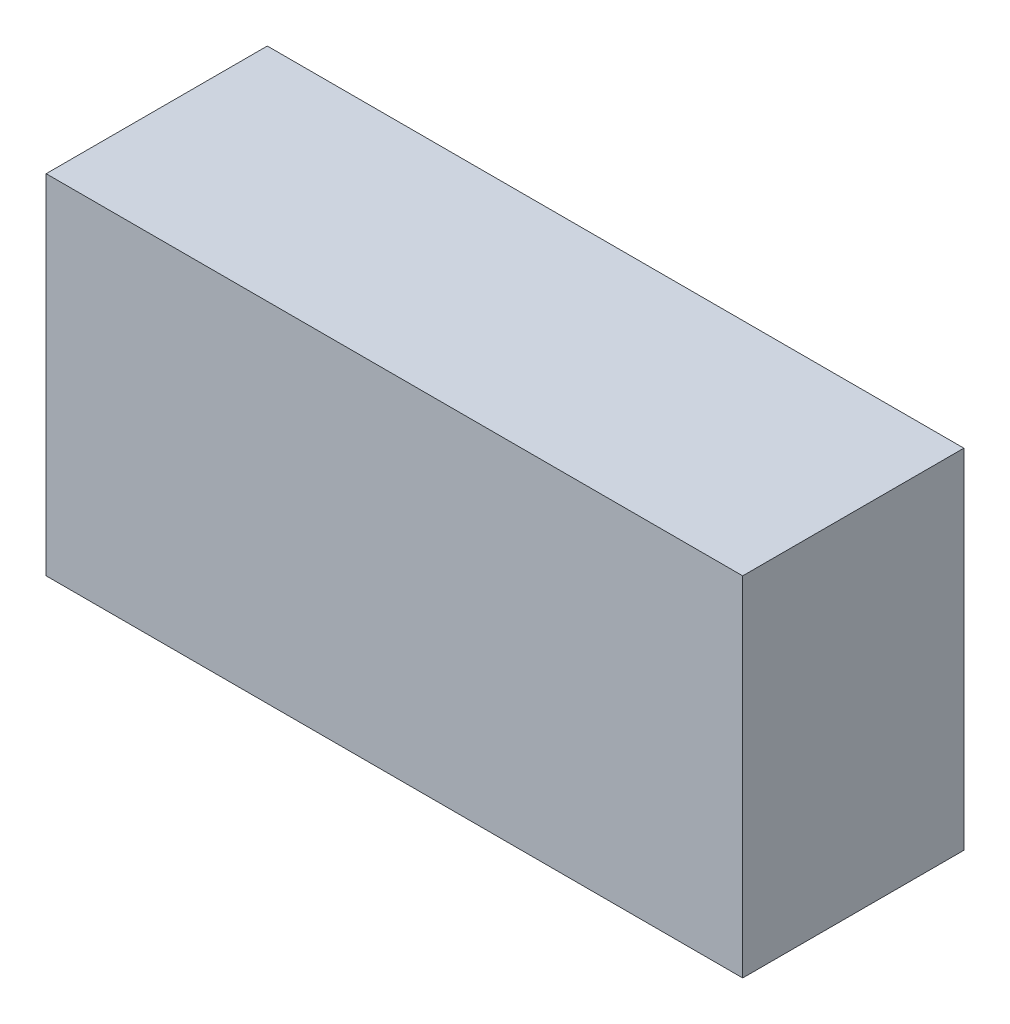
ISO-10303-21;
HEADER;
FILE_DESCRIPTION(('STEP AP214'),'2;1');
FILE_NAME('part.step','',(''),(''),'','','');
FILE_SCHEMA(('AUTOMOTIVE_DESIGN { 1 0 10303 214 1 1 1 1 }'));
ENDSEC;
DATA;
#1=APPLICATION_CONTEXT('core data for automotive mechanical design processes');
#2=APPLICATION_PROTOCOL_DEFINITION('international standard','automotive_design',2000,#1);
#3=PRODUCT_CONTEXT('',#1,'mechanical');
#4=PRODUCT('Part','Part','',(#3));
#5=PRODUCT_RELATED_PRODUCT_CATEGORY('part','',(#4));
#6=PRODUCT_DEFINITION_FORMATION('','',#4);
#7=PRODUCT_DEFINITION_CONTEXT('part definition',#1,'design');
#8=PRODUCT_DEFINITION('design','',#6,#7);
#9=PRODUCT_DEFINITION_SHAPE('','',#8);
#10=(LENGTH_UNIT() NAMED_UNIT(*) SI_UNIT(.MILLI.,.METRE.));
#11=(NAMED_UNIT(*) PLANE_ANGLE_UNIT() SI_UNIT($,.RADIAN.));
#12=(NAMED_UNIT(*) SI_UNIT($,.STERADIAN.) SOLID_ANGLE_UNIT());
#13=UNCERTAINTY_MEASURE_WITH_UNIT(LENGTH_MEASURE(1.E-05),#10,'distance_accuracy_value','');
#14=(GEOMETRIC_REPRESENTATION_CONTEXT(3) GLOBAL_UNCERTAINTY_ASSIGNED_CONTEXT((#13)) GLOBAL_UNIT_ASSIGNED_CONTEXT((#10,
#11,#12)) REPRESENTATION_CONTEXT('',''));
#15=CARTESIAN_POINT('',(0.,0.,0.));
#16=DIRECTION('',(0.,0.,1.));
#17=DIRECTION('',(1.,0.,0.));
#18=AXIS2_PLACEMENT_3D('',#15,#16,#17);
#19=CARTESIAN_POINT('',(-0.3999992,0.1999996,0.254));
#20=DIRECTION('',(0.,0.,-1.));
#21=DIRECTION('',(0.,-1.,0.));
#22=AXIS2_PLACEMENT_3D('',#19,#20,#21);
#23=PLANE('',#22);
#24=DIRECTION('',(0.,-1.,0.));
#25=VECTOR('',#24,1.);
#26=CARTESIAN_POINT('',(-0.3999992,0.1999996,0.254));
#27=LINE('',#26,#25);
#28=CARTESIAN_POINT('',(-0.3999992,0.1999996,0.254));
#29=VERTEX_POINT('',#28);
#30=CARTESIAN_POINT('',(-0.3999992,-0.1999996,0.254));
#31=VERTEX_POINT('',#30);
#32=EDGE_CURVE('E89',#29,#31,#27,.T.);
#33=ORIENTED_EDGE('',*,*,#32,.T.);
#34=DIRECTION('',(1.,0.,0.));
#35=VECTOR('',#34,1.);
#36=CARTESIAN_POINT('',(-0.3999992,-0.1999996,0.254));
#37=LINE('',#36,#35);
#38=CARTESIAN_POINT('',(0.40000174,-0.1999996,0.254));
#39=VERTEX_POINT('',#38);
#40=EDGE_CURVE('E80',#31,#39,#37,.T.);
#41=ORIENTED_EDGE('',*,*,#40,.T.);
#42=DIRECTION('',(0.,1.,0.));
#43=VECTOR('',#42,1.);
#44=CARTESIAN_POINT('',(0.40000174,-0.1999996,0.254));
#45=LINE('',#44,#43);
#46=CARTESIAN_POINT('',(0.40000174,0.1999996,0.254));
#47=VERTEX_POINT('',#46);
#48=EDGE_CURVE('E107',#39,#47,#45,.T.);
#49=ORIENTED_EDGE('',*,*,#48,.T.);
#50=DIRECTION('',(-1.,0.,0.));
#51=VECTOR('',#50,1.);
#52=CARTESIAN_POINT('',(0.40000174,0.1999996,0.254));
#53=LINE('',#52,#51);
#54=EDGE_CURVE('E11',#47,#29,#53,.T.);
#55=ORIENTED_EDGE('',*,*,#54,.T.);
#56=EDGE_LOOP('',(#33,#41,#49,#55));
#57=FACE_BOUND('',#56,.T.);
#58=ADVANCED_FACE('F17',(#57),#23,.F.);
#59=CARTESIAN_POINT('',(-0.3999992,0.1999996,0.));
#60=DIRECTION('',(0.,0.,-1.));
#61=DIRECTION('',(0.,-1.,0.));
#62=AXIS2_PLACEMENT_3D('',#59,#60,#61);
#63=PLANE('',#62);
#64=DIRECTION('',(0.,-1.,0.));
#65=VECTOR('',#64,1.);
#66=CARTESIAN_POINT('',(-0.3999992,0.1999996,0.));
#67=LINE('',#66,#65);
#68=CARTESIAN_POINT('',(-0.3999992,0.1999996,0.));
#69=VERTEX_POINT('',#68);
#70=CARTESIAN_POINT('',(-0.3999992,-0.1999996,0.));
#71=VERTEX_POINT('',#70);
#72=EDGE_CURVE('E95',#69,#71,#67,.T.);
#73=ORIENTED_EDGE('',*,*,#72,.F.);
#74=DIRECTION('',(-1.,0.,0.));
#75=VECTOR('',#74,1.);
#76=CARTESIAN_POINT('',(0.40000174,0.1999996,0.));
#77=LINE('',#76,#75);
#78=CARTESIAN_POINT('',(0.40000174,0.1999996,0.));
#79=VERTEX_POINT('',#78);
#80=EDGE_CURVE('E27',#79,#69,#77,.T.);
#81=ORIENTED_EDGE('',*,*,#80,.F.);
#82=DIRECTION('',(0.,1.,0.));
#83=VECTOR('',#82,1.);
#84=CARTESIAN_POINT('',(0.40000174,-0.1999996,0.));
#85=LINE('',#84,#83);
#86=CARTESIAN_POINT('',(0.40000174,-0.1999996,0.));
#87=VERTEX_POINT('',#86);
#88=EDGE_CURVE('E21',#87,#79,#85,.T.);
#89=ORIENTED_EDGE('',*,*,#88,.F.);
#90=DIRECTION('',(1.,0.,0.));
#91=VECTOR('',#90,1.);
#92=CARTESIAN_POINT('',(-0.3999992,-0.1999996,0.));
#93=LINE('',#92,#91);
#94=EDGE_CURVE('E73',#71,#87,#93,.T.);
#95=ORIENTED_EDGE('',*,*,#94,.F.);
#96=EDGE_LOOP('',(#73,#81,#89,#95));
#97=FACE_BOUND('',#96,.T.);
#98=ADVANCED_FACE('F120',(#97),#63,.T.);
#99=CARTESIAN_POINT('',(0.40000174,0.1999996,0.));
#100=DIRECTION('',(0.,-1.,0.));
#101=DIRECTION('',(0.,0.,-1.));
#102=AXIS2_PLACEMENT_3D('',#99,#100,#101);
#103=PLANE('',#102);
#104=DIRECTION('',(0.,0.,1.));
#105=VECTOR('',#104,1.);
#106=CARTESIAN_POINT('',(0.40000174,0.1999996,0.));
#107=LINE('',#106,#105);
#108=EDGE_CURVE('E110',#79,#47,#107,.T.);
#109=ORIENTED_EDGE('',*,*,#108,.F.);
#110=ORIENTED_EDGE('',*,*,#80,.T.);
#111=DIRECTION('',(0.,0.,1.));
#112=VECTOR('',#111,1.);
#113=CARTESIAN_POINT('',(-0.3999992,0.1999996,0.));
#114=LINE('',#113,#112);
#115=EDGE_CURVE('E102',#69,#29,#114,.T.);
#116=ORIENTED_EDGE('',*,*,#115,.T.);
#117=ORIENTED_EDGE('',*,*,#54,.F.);
#118=EDGE_LOOP('',(#109,#110,#116,#117));
#119=FACE_BOUND('',#118,.T.);
#120=ADVANCED_FACE('F19',(#119),#103,.F.);
#121=CARTESIAN_POINT('',(0.40000174,-0.1999996,0.));
#122=DIRECTION('',(-1.,0.,0.));
#123=DIRECTION('',(0.,0.,1.));
#124=AXIS2_PLACEMENT_3D('',#121,#122,#123);
#125=PLANE('',#124);
#126=DIRECTION('',(0.,0.,1.));
#127=VECTOR('',#126,1.);
#128=CARTESIAN_POINT('',(0.40000174,-0.1999996,0.));
#129=LINE('',#128,#127);
#130=EDGE_CURVE('E86',#87,#39,#129,.T.);
#131=ORIENTED_EDGE('',*,*,#130,.F.);
#132=ORIENTED_EDGE('',*,*,#88,.T.);
#133=ORIENTED_EDGE('',*,*,#108,.T.);
#134=ORIENTED_EDGE('',*,*,#48,.F.);
#135=EDGE_LOOP('',(#131,#132,#133,#134));
#136=FACE_BOUND('',#135,.T.);
#137=ADVANCED_FACE('F129',(#136),#125,.F.);
#138=CARTESIAN_POINT('',(-0.3999992,-0.1999996,0.));
#139=DIRECTION('',(0.,1.,0.));
#140=DIRECTION('',(1.,0.,0.));
#141=AXIS2_PLACEMENT_3D('',#138,#139,#140);
#142=PLANE('',#141);
#143=DIRECTION('',(0.,0.,1.));
#144=VECTOR('',#143,1.);
#145=CARTESIAN_POINT('',(-0.3999992,-0.1999996,0.));
#146=LINE('',#145,#144);
#147=EDGE_CURVE('E83',#71,#31,#146,.T.);
#148=ORIENTED_EDGE('',*,*,#147,.F.);
#149=ORIENTED_EDGE('',*,*,#94,.T.);
#150=ORIENTED_EDGE('',*,*,#130,.T.);
#151=ORIENTED_EDGE('',*,*,#40,.F.);
#152=EDGE_LOOP('',(#148,#149,#150,#151));
#153=FACE_BOUND('',#152,.T.);
#154=ADVANCED_FACE('F81',(#153),#142,.F.);
#155=CARTESIAN_POINT('',(-0.3999992,0.1999996,0.));
#156=DIRECTION('',(1.,0.,0.));
#157=DIRECTION('',(0.,1.,0.));
#158=AXIS2_PLACEMENT_3D('',#155,#156,#157);
#159=PLANE('',#158);
#160=ORIENTED_EDGE('',*,*,#115,.F.);
#161=ORIENTED_EDGE('',*,*,#72,.T.);
#162=ORIENTED_EDGE('',*,*,#147,.T.);
#163=ORIENTED_EDGE('',*,*,#32,.F.);
#164=EDGE_LOOP('',(#160,#161,#162,#163));
#165=FACE_BOUND('',#164,.T.);
#166=ADVANCED_FACE('F94',(#165),#159,.F.);
#167=CLOSED_SHELL('',(#58,#98,#120,#137,#154,#166));
#168=MANIFOLD_SOLID_BREP('B1',#167);
#169=ADVANCED_BREP_SHAPE_REPRESENTATION('',(#18,#168),#14);
#170=SHAPE_DEFINITION_REPRESENTATION(#9,#169);
ENDSEC;
END-ISO-10303-21;
